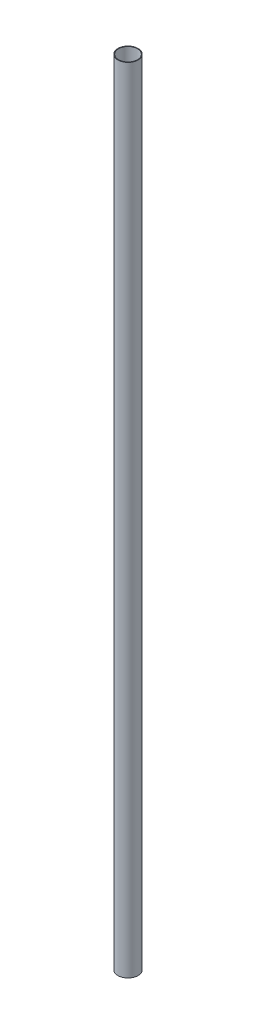
ISO-10303-21;
HEADER;
FILE_DESCRIPTION(('STEP AP214'),'2;1');
FILE_NAME('part.step','',(''),(''),'','','');
FILE_SCHEMA(('AUTOMOTIVE_DESIGN { 1 0 10303 214 1 1 1 1 }'));
ENDSEC;
DATA;
#1=APPLICATION_CONTEXT('core data for automotive mechanical design processes');
#2=APPLICATION_PROTOCOL_DEFINITION('international standard','automotive_design',2000,#1);
#3=PRODUCT_CONTEXT('',#1,'mechanical');
#4=PRODUCT('Part','Part','',(#3));
#5=PRODUCT_RELATED_PRODUCT_CATEGORY('part','',(#4));
#6=PRODUCT_DEFINITION_FORMATION('','',#4);
#7=PRODUCT_DEFINITION_CONTEXT('part definition',#1,'design');
#8=PRODUCT_DEFINITION('design','',#6,#7);
#9=PRODUCT_DEFINITION_SHAPE('','',#8);
#10=(LENGTH_UNIT() NAMED_UNIT(*) SI_UNIT(.MILLI.,.METRE.));
#11=(NAMED_UNIT(*) PLANE_ANGLE_UNIT() SI_UNIT($,.RADIAN.));
#12=(NAMED_UNIT(*) SI_UNIT($,.STERADIAN.) SOLID_ANGLE_UNIT());
#13=UNCERTAINTY_MEASURE_WITH_UNIT(LENGTH_MEASURE(1.E-05),#10,'distance_accuracy_value','');
#14=(GEOMETRIC_REPRESENTATION_CONTEXT(3) GLOBAL_UNCERTAINTY_ASSIGNED_CONTEXT((#13)) GLOBAL_UNIT_ASSIGNED_CONTEXT((#10,
#11,#12)) REPRESENTATION_CONTEXT('',''));
#15=CARTESIAN_POINT('',(0.,0.,0.));
#16=DIRECTION('',(0.,0.,1.));
#17=DIRECTION('',(1.,0.,0.));
#18=AXIS2_PLACEMENT_3D('',#15,#16,#17);
#19=CARTESIAN_POINT('',(0.,1651.,0.));
#20=DIRECTION('',(0.,1.,0.));
#21=DIRECTION('',(0.,0.,1.));
#22=AXIS2_PLACEMENT_3D('',#19,#20,#21);
#23=PLANE('',#22);
#24=CARTESIAN_POINT('',(0.,1651.,0.));
#25=DIRECTION('',(0.,1.,0.));
#26=DIRECTION('',(0.,0.,1.));
#27=AXIS2_PLACEMENT_3D('',#24,#25,#26);
#28=CIRCLE('',#27,20.955);
#29=CARTESIAN_POINT('',(0.,1651.,20.955));
#30=VERTEX_POINT('',#29);
#31=EDGE_CURVE('E10',#30,#30,#28,.T.);
#32=ORIENTED_EDGE('',*,*,#31,.T.);
#33=EDGE_LOOP('',(#32));
#34=FACE_BOUND('',#33,.T.);
#35=CARTESIAN_POINT('',(0.,1651.,0.));
#36=DIRECTION('',(0.,1.,0.));
#37=DIRECTION('',(0.,0.,1.));
#38=AXIS2_PLACEMENT_3D('',#35,#36,#37);
#39=CIRCLE('',#38,19.685);
#40=CARTESIAN_POINT('',(0.,1651.,19.685));
#41=VERTEX_POINT('',#40);
#42=EDGE_CURVE('E41',#41,#41,#39,.T.);
#43=ORIENTED_EDGE('',*,*,#42,.F.);
#44=EDGE_LOOP('',(#43));
#45=FACE_BOUND('',#44,.T.);
#46=ADVANCED_FACE('F30',(#34,#45),#23,.T.);
#47=CARTESIAN_POINT('',(0.,0.,0.));
#48=DIRECTION('',(0.,1.,0.));
#49=DIRECTION('',(0.,0.,1.));
#50=AXIS2_PLACEMENT_3D('',#47,#48,#49);
#51=PLANE('',#50);
#52=CARTESIAN_POINT('',(0.,0.,0.));
#53=DIRECTION('',(0.,1.,0.));
#54=DIRECTION('',(0.,0.,1.));
#55=AXIS2_PLACEMENT_3D('',#52,#53,#54);
#56=CIRCLE('',#55,20.955);
#57=CARTESIAN_POINT('',(0.,0.,20.955));
#58=VERTEX_POINT('',#57);
#59=EDGE_CURVE('E34',#58,#58,#56,.T.);
#60=ORIENTED_EDGE('',*,*,#59,.F.);
#61=EDGE_LOOP('',(#60));
#62=FACE_BOUND('',#61,.T.);
#63=CARTESIAN_POINT('',(0.,0.,0.));
#64=DIRECTION('',(0.,1.,0.));
#65=DIRECTION('',(0.,0.,1.));
#66=AXIS2_PLACEMENT_3D('',#63,#64,#65);
#67=CIRCLE('',#66,19.685);
#68=CARTESIAN_POINT('',(0.,0.,19.685));
#69=VERTEX_POINT('',#68);
#70=EDGE_CURVE('E43',#69,#69,#67,.T.);
#71=ORIENTED_EDGE('',*,*,#70,.T.);
#72=EDGE_LOOP('',(#71));
#73=FACE_BOUND('',#72,.T.);
#74=ADVANCED_FACE('F53',(#62,#73),#51,.F.);
#75=CARTESIAN_POINT('',(0.,1651.,0.));
#76=DIRECTION('',(0.,-1.,0.));
#77=DIRECTION('',(0.,0.,-1.));
#78=AXIS2_PLACEMENT_3D('',#75,#76,#77);
#79=CYLINDRICAL_SURFACE('',#78,20.955);
#80=ORIENTED_EDGE('',*,*,#31,.F.);
#81=EDGE_LOOP('',(#80));
#82=FACE_BOUND('',#81,.T.);
#83=ORIENTED_EDGE('',*,*,#59,.T.);
#84=EDGE_LOOP('',(#83));
#85=FACE_BOUND('',#84,.T.);
#86=ADVANCED_FACE('F32',(#82,#85),#79,.T.);
#87=CARTESIAN_POINT('',(0.,1651.,0.));
#88=DIRECTION('',(0.,-1.,0.));
#89=DIRECTION('',(0.,0.,-1.));
#90=AXIS2_PLACEMENT_3D('',#87,#88,#89);
#91=CYLINDRICAL_SURFACE('',#90,19.685);
#92=ORIENTED_EDGE('',*,*,#42,.T.);
#93=EDGE_LOOP('',(#92));
#94=FACE_BOUND('',#93,.T.);
#95=ORIENTED_EDGE('',*,*,#70,.F.);
#96=EDGE_LOOP('',(#95));
#97=FACE_BOUND('',#96,.T.);
#98=ADVANCED_FACE('F49',(#94,#97),#91,.F.);
#99=CLOSED_SHELL('',(#46,#74,#86,#98));
#100=MANIFOLD_SOLID_BREP('B2',#99);
#101=ADVANCED_BREP_SHAPE_REPRESENTATION('',(#18,#100),#14);
#102=SHAPE_DEFINITION_REPRESENTATION(#9,#101);
ENDSEC;
END-ISO-10303-21;
